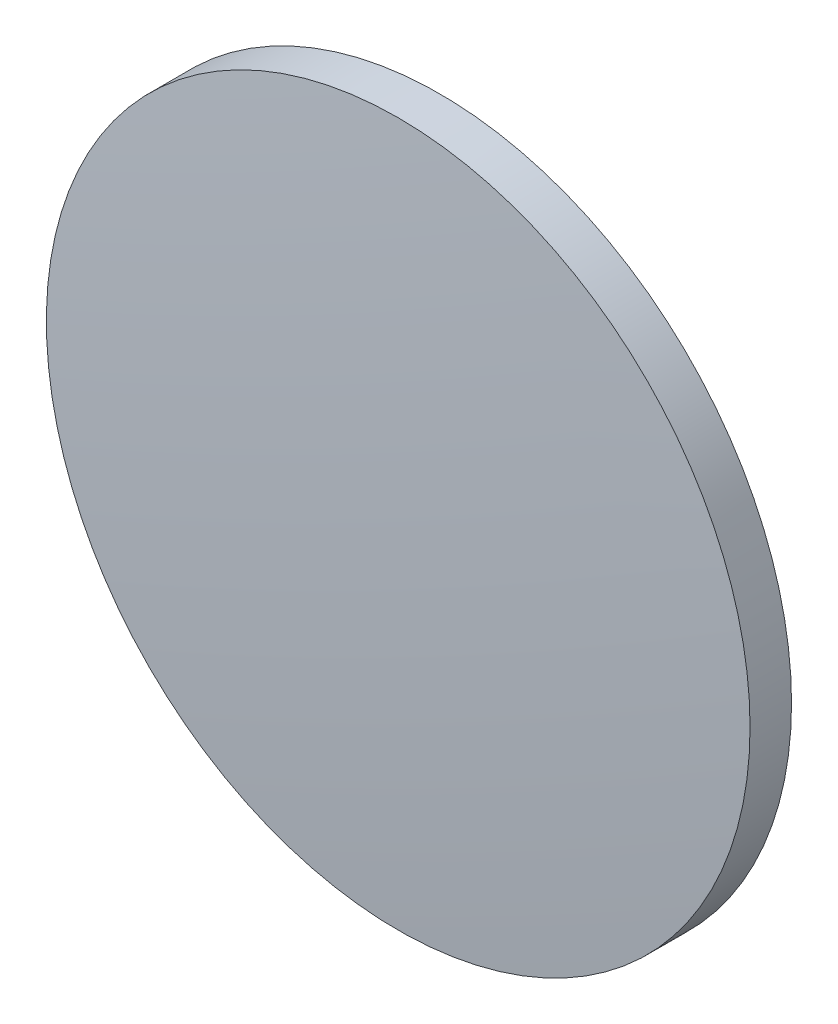
ISO-10303-21;
HEADER;
FILE_DESCRIPTION(('STEP AP214'),'2;1');
FILE_NAME('part.step','',(''),(''),'','','');
FILE_SCHEMA(('AUTOMOTIVE_DESIGN { 1 0 10303 214 1 1 1 1 }'));
ENDSEC;
DATA;
#1=APPLICATION_CONTEXT('core data for automotive mechanical design processes');
#2=APPLICATION_PROTOCOL_DEFINITION('international standard','automotive_design',2000,#1);
#3=PRODUCT_CONTEXT('',#1,'mechanical');
#4=PRODUCT('Part','Part','',(#3));
#5=PRODUCT_RELATED_PRODUCT_CATEGORY('part','',(#4));
#6=PRODUCT_DEFINITION_FORMATION('','',#4);
#7=PRODUCT_DEFINITION_CONTEXT('part definition',#1,'design');
#8=PRODUCT_DEFINITION('design','',#6,#7);
#9=PRODUCT_DEFINITION_SHAPE('','',#8);
#10=(LENGTH_UNIT() NAMED_UNIT(*) SI_UNIT(.MILLI.,.METRE.));
#11=(NAMED_UNIT(*) PLANE_ANGLE_UNIT() SI_UNIT($,.RADIAN.));
#12=(NAMED_UNIT(*) SI_UNIT($,.STERADIAN.) SOLID_ANGLE_UNIT());
#13=UNCERTAINTY_MEASURE_WITH_UNIT(LENGTH_MEASURE(1.E-05),#10,'distance_accuracy_value','');
#14=(GEOMETRIC_REPRESENTATION_CONTEXT(3) GLOBAL_UNCERTAINTY_ASSIGNED_CONTEXT((#13)) GLOBAL_UNIT_ASSIGNED_CONTEXT((#10,
#11,#12)) REPRESENTATION_CONTEXT('',''));
#15=CARTESIAN_POINT('',(0.,0.,0.));
#16=DIRECTION('',(0.,0.,1.));
#17=DIRECTION('',(1.,0.,0.));
#18=AXIS2_PLACEMENT_3D('',#15,#16,#17);
#19=CARTESIAN_POINT('',(0.,0.,-384.395));
#20=DIRECTION('',(0.,0.,1.));
#21=DIRECTION('',(0.,1.,0.));
#22=AXIS2_PLACEMENT_3D('',#19,#20,#21);
#23=SPHERICAL_SURFACE('',#22,386.31);
#24=CARTESIAN_POINT('',(0.,0.,1.07906670228803));
#25=DIRECTION('',(0.,0.,1.));
#26=DIRECTION('',(1.,0.,0.));
#27=AXIS2_PLACEMENT_3D('',#24,#25,#26);
#28=CIRCLE('',#27,25.4);
#29=CARTESIAN_POINT('',(25.4,0.,1.07906670228803));
#30=VERTEX_POINT('',#29);
#31=EDGE_CURVE('E8',#30,#30,#28,.T.);
#32=ORIENTED_EDGE('',*,*,#31,.T.);
#33=EDGE_LOOP('',(#32));
#34=FACE_BOUND('',#33,.T.);
#35=ADVANCED_FACE('F12',(#34),#23,.T.);
#36=CARTESIAN_POINT('',(0.,0.,4.30813204540037));
#37=DIRECTION('',(0.,0.,1.));
#38=DIRECTION('',(1.,0.,0.));
#39=AXIS2_PLACEMENT_3D('',#36,#37,#38);
#40=CYLINDRICAL_SURFACE('',#39,25.4);
#41=ORIENTED_EDGE('',*,*,#31,.F.);
#42=EDGE_LOOP('',(#41));
#43=FACE_BOUND('',#42,.T.);
#44=CARTESIAN_POINT('',(0.,0.,-1.915));
#45=DIRECTION('',(0.,0.,1.));
#46=DIRECTION('',(1.,0.,0.));
#47=AXIS2_PLACEMENT_3D('',#44,#45,#46);
#48=CIRCLE('',#47,25.4);
#49=CARTESIAN_POINT('',(25.4,0.,-1.915));
#50=VERTEX_POINT('',#49);
#51=EDGE_CURVE('E18',#50,#50,#48,.T.);
#52=ORIENTED_EDGE('',*,*,#51,.T.);
#53=EDGE_LOOP('',(#52));
#54=FACE_BOUND('',#53,.T.);
#55=ADVANCED_FACE('F24',(#43,#54),#40,.T.);
#56=CARTESIAN_POINT('',(0.,0.,-1.915));
#57=DIRECTION('',(0.,0.,1.));
#58=DIRECTION('',(1.,0.,0.));
#59=AXIS2_PLACEMENT_3D('',#56,#57,#58);
#60=PLANE('',#59);
#61=ORIENTED_EDGE('',*,*,#51,.F.);
#62=EDGE_LOOP('',(#61));
#63=FACE_BOUND('',#62,.T.);
#64=ADVANCED_FACE('F26',(#63),#60,.F.);
#65=CLOSED_SHELL('',(#35,#55,#64));
#66=MANIFOLD_SOLID_BREP('B1',#65);
#67=ADVANCED_BREP_SHAPE_REPRESENTATION('',(#18,#66),#14);
#68=SHAPE_DEFINITION_REPRESENTATION(#9,#67);
ENDSEC;
END-ISO-10303-21;
